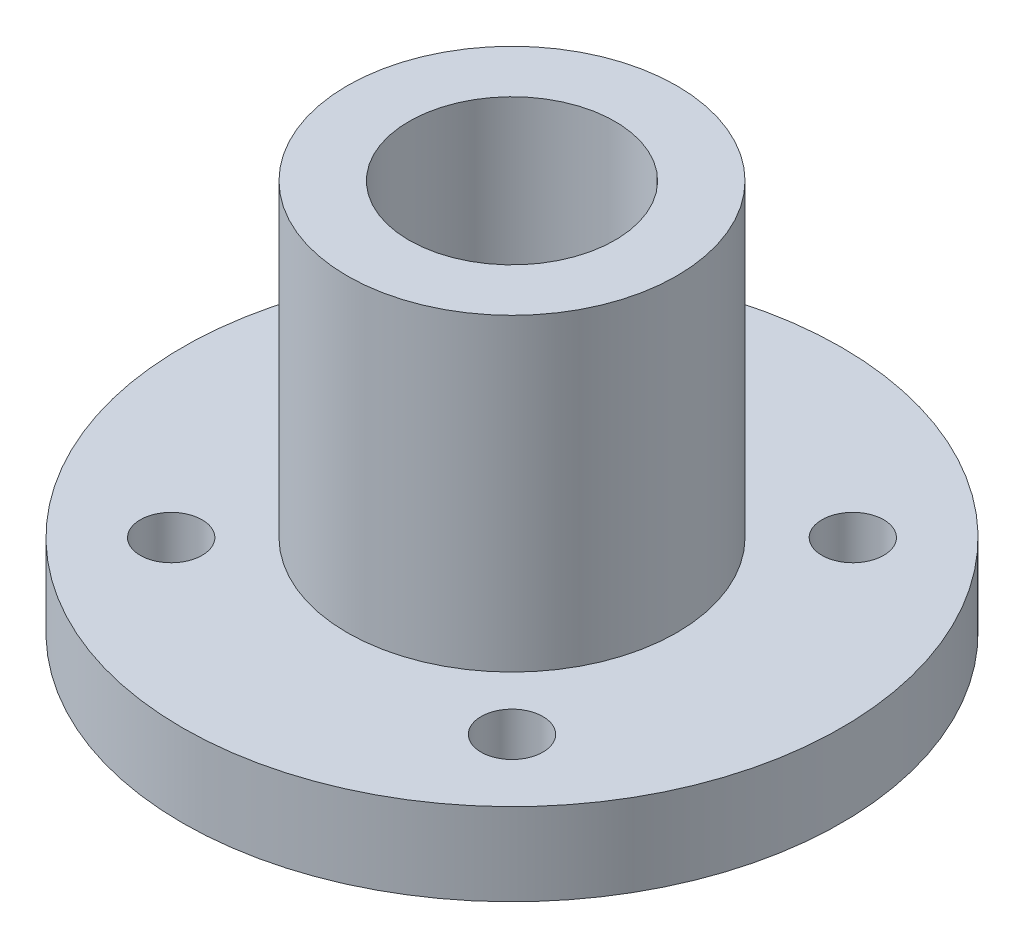
ISO-10303-21;
HEADER;
FILE_DESCRIPTION(('STEP AP214'),'2;1');
FILE_NAME('part.step','',(''),(''),'','','');
FILE_SCHEMA(('AUTOMOTIVE_DESIGN { 1 0 10303 214 1 1 1 1 }'));
ENDSEC;
DATA;
#1=APPLICATION_CONTEXT('core data for automotive mechanical design processes');
#2=APPLICATION_PROTOCOL_DEFINITION('international standard','automotive_design',2000,#1);
#3=PRODUCT_CONTEXT('',#1,'mechanical');
#4=PRODUCT('Part','Part','',(#3));
#5=PRODUCT_RELATED_PRODUCT_CATEGORY('part','',(#4));
#6=PRODUCT_DEFINITION_FORMATION('','',#4);
#7=PRODUCT_DEFINITION_CONTEXT('part definition',#1,'design');
#8=PRODUCT_DEFINITION('design','',#6,#7);
#9=PRODUCT_DEFINITION_SHAPE('','',#8);
#10=(LENGTH_UNIT() NAMED_UNIT(*) SI_UNIT(.MILLI.,.METRE.));
#11=(NAMED_UNIT(*) PLANE_ANGLE_UNIT() SI_UNIT($,.RADIAN.));
#12=(NAMED_UNIT(*) SI_UNIT($,.STERADIAN.) SOLID_ANGLE_UNIT());
#13=UNCERTAINTY_MEASURE_WITH_UNIT(LENGTH_MEASURE(1.E-05),#10,'distance_accuracy_value','');
#14=(GEOMETRIC_REPRESENTATION_CONTEXT(3) GLOBAL_UNCERTAINTY_ASSIGNED_CONTEXT((#13)) GLOBAL_UNIT_ASSIGNED_CONTEXT((#10,
#11,#12)) REPRESENTATION_CONTEXT('',''));
#15=CARTESIAN_POINT('',(0.,0.,0.));
#16=DIRECTION('',(0.,0.,1.));
#17=DIRECTION('',(1.,0.,0.));
#18=AXIS2_PLACEMENT_3D('',#15,#16,#17);
#19=CARTESIAN_POINT('',(0.,4.,0.));
#20=DIRECTION('',(0.,1.,0.));
#21=DIRECTION('',(0.,0.,1.));
#22=AXIS2_PLACEMENT_3D('',#19,#20,#21);
#23=PLANE('',#22);
#24=CARTESIAN_POINT('',(-8.27314933988262,4.,-8.27314933988259));
#25=DIRECTION('',(0.,1.,0.));
#26=DIRECTION('',(0.,0.,1.));
#27=AXIS2_PLACEMENT_3D('',#24,#25,#26);
#28=CIRCLE('',#27,1.5);
#29=CARTESIAN_POINT('',(-8.27314933988262,4.,-6.77314933988259));
#30=VERTEX_POINT('',#29);
#31=EDGE_CURVE('E68',#30,#30,#28,.T.);
#32=ORIENTED_EDGE('',*,*,#31,.F.);
#33=EDGE_LOOP('',(#32));
#34=FACE_BOUND('',#33,.T.);
#35=CARTESIAN_POINT('',(-8.27314933988262,4.,8.27314933988259));
#36=DIRECTION('',(0.,1.,0.));
#37=DIRECTION('',(0.,0.,-1.));
#38=AXIS2_PLACEMENT_3D('',#35,#36,#37);
#39=CIRCLE('',#38,1.5);
#40=CARTESIAN_POINT('',(-8.27314933988262,4.,6.77314933988259));
#41=VERTEX_POINT('',#40);
#42=EDGE_CURVE('E58',#41,#41,#39,.T.);
#43=ORIENTED_EDGE('',*,*,#42,.F.);
#44=EDGE_LOOP('',(#43));
#45=FACE_BOUND('',#44,.T.);
#46=CARTESIAN_POINT('',(8.27314933988262,4.,8.27314933988259));
#47=DIRECTION('',(0.,1.,0.));
#48=DIRECTION('',(0.,0.,1.));
#49=AXIS2_PLACEMENT_3D('',#46,#47,#48);
#50=CIRCLE('',#49,1.5);
#51=CARTESIAN_POINT('',(8.27314933988262,4.,9.77314933988259));
#52=VERTEX_POINT('',#51);
#53=EDGE_CURVE('E48',#52,#52,#50,.T.);
#54=ORIENTED_EDGE('',*,*,#53,.F.);
#55=EDGE_LOOP('',(#54));
#56=FACE_BOUND('',#55,.T.);
#57=CARTESIAN_POINT('',(0.,4.,0.));
#58=DIRECTION('',(0.,1.,0.));
#59=DIRECTION('',(0.,0.,1.));
#60=AXIS2_PLACEMENT_3D('',#57,#58,#59);
#61=CIRCLE('',#60,16.);
#62=CARTESIAN_POINT('',(0.,4.,16.));
#63=VERTEX_POINT('',#62);
#64=EDGE_CURVE('E10',#63,#63,#61,.T.);
#65=ORIENTED_EDGE('',*,*,#64,.T.);
#66=EDGE_LOOP('',(#65));
#67=FACE_BOUND('',#66,.T.);
#68=CARTESIAN_POINT('',(8.27314933988262,4.,-8.27314933988259));
#69=DIRECTION('',(0.,1.,0.));
#70=DIRECTION('',(0.,0.,-1.));
#71=AXIS2_PLACEMENT_3D('',#68,#69,#70);
#72=CIRCLE('',#71,1.5);
#73=CARTESIAN_POINT('',(8.27314933988262,4.,-9.77314933988259));
#74=VERTEX_POINT('',#73);
#75=EDGE_CURVE('E62',#74,#74,#72,.T.);
#76=ORIENTED_EDGE('',*,*,#75,.F.);
#77=EDGE_LOOP('',(#76));
#78=FACE_BOUND('',#77,.T.);
#79=CARTESIAN_POINT('',(0.,4.,0.));
#80=DIRECTION('',(0.,1.,0.));
#81=DIRECTION('',(0.,0.,1.));
#82=AXIS2_PLACEMENT_3D('',#79,#80,#81);
#83=CIRCLE('',#82,8.);
#84=CARTESIAN_POINT('',(0.,4.,8.));
#85=VERTEX_POINT('',#84);
#86=EDGE_CURVE('E77',#85,#85,#83,.T.);
#87=ORIENTED_EDGE('',*,*,#86,.F.);
#88=EDGE_LOOP('',(#87));
#89=FACE_BOUND('',#88,.T.);
#90=ADVANCED_FACE('F37',(#34,#45,#56,#67,#78,#89),#23,.T.);
#91=CARTESIAN_POINT('',(0.,0.,0.));
#92=DIRECTION('',(0.,1.,0.));
#93=DIRECTION('',(0.,0.,1.));
#94=AXIS2_PLACEMENT_3D('',#91,#92,#93);
#95=PLANE('',#94);
#96=CARTESIAN_POINT('',(0.,0.,0.));
#97=DIRECTION('',(0.,1.,0.));
#98=DIRECTION('',(0.,0.,1.));
#99=AXIS2_PLACEMENT_3D('',#96,#97,#98);
#100=CIRCLE('',#99,16.);
#101=CARTESIAN_POINT('',(0.,0.,16.));
#102=VERTEX_POINT('',#101);
#103=EDGE_CURVE('E41',#102,#102,#100,.T.);
#104=ORIENTED_EDGE('',*,*,#103,.F.);
#105=EDGE_LOOP('',(#104));
#106=FACE_BOUND('',#105,.T.);
#107=CARTESIAN_POINT('',(8.27314933988262,0.,8.27314933988259));
#108=DIRECTION('',(0.,1.,0.));
#109=DIRECTION('',(0.,0.,1.));
#110=AXIS2_PLACEMENT_3D('',#107,#108,#109);
#111=CIRCLE('',#110,1.5);
#112=CARTESIAN_POINT('',(8.27314933988262,0.,9.77314933988259));
#113=VERTEX_POINT('',#112);
#114=EDGE_CURVE('E50',#113,#113,#111,.T.);
#115=ORIENTED_EDGE('',*,*,#114,.T.);
#116=EDGE_LOOP('',(#115));
#117=FACE_BOUND('',#116,.T.);
#118=CARTESIAN_POINT('',(0.,0.,0.));
#119=DIRECTION('',(0.,1.,0.));
#120=DIRECTION('',(0.,0.,1.));
#121=AXIS2_PLACEMENT_3D('',#118,#119,#120);
#122=CIRCLE('',#121,5.);
#123=CARTESIAN_POINT('',(0.,0.,5.));
#124=VERTEX_POINT('',#123);
#125=EDGE_CURVE('E53',#124,#124,#122,.T.);
#126=ORIENTED_EDGE('',*,*,#125,.T.);
#127=EDGE_LOOP('',(#126));
#128=FACE_BOUND('',#127,.T.);
#129=CARTESIAN_POINT('',(-8.27314933988262,0.,8.27314933988259));
#130=DIRECTION('',(0.,1.,0.));
#131=DIRECTION('',(0.,0.,-1.));
#132=AXIS2_PLACEMENT_3D('',#129,#130,#131);
#133=CIRCLE('',#132,1.5);
#134=CARTESIAN_POINT('',(-8.27314933988262,0.,6.77314933988259));
#135=VERTEX_POINT('',#134);
#136=EDGE_CURVE('E59',#135,#135,#133,.T.);
#137=ORIENTED_EDGE('',*,*,#136,.T.);
#138=EDGE_LOOP('',(#137));
#139=FACE_BOUND('',#138,.T.);
#140=CARTESIAN_POINT('',(8.27314933988262,0.,-8.27314933988259));
#141=DIRECTION('',(0.,1.,0.));
#142=DIRECTION('',(0.,0.,-1.));
#143=AXIS2_PLACEMENT_3D('',#140,#141,#142);
#144=CIRCLE('',#143,1.5);
#145=CARTESIAN_POINT('',(8.27314933988262,0.,-9.77314933988259));
#146=VERTEX_POINT('',#145);
#147=EDGE_CURVE('E65',#146,#146,#144,.T.);
#148=ORIENTED_EDGE('',*,*,#147,.T.);
#149=EDGE_LOOP('',(#148));
#150=FACE_BOUND('',#149,.T.);
#151=CARTESIAN_POINT('',(-8.27314933988262,0.,-8.27314933988259));
#152=DIRECTION('',(0.,1.,0.));
#153=DIRECTION('',(0.,0.,1.));
#154=AXIS2_PLACEMENT_3D('',#151,#152,#153);
#155=CIRCLE('',#154,1.5);
#156=CARTESIAN_POINT('',(-8.27314933988262,0.,-6.77314933988259));
#157=VERTEX_POINT('',#156);
#158=EDGE_CURVE('E71',#157,#157,#155,.T.);
#159=ORIENTED_EDGE('',*,*,#158,.T.);
#160=EDGE_LOOP('',(#159));
#161=FACE_BOUND('',#160,.T.);
#162=ADVANCED_FACE('F104',(#106,#117,#128,#139,#150,#161),#95,.F.);
#163=CARTESIAN_POINT('',(0.,4.,0.));
#164=DIRECTION('',(0.,-1.,0.));
#165=DIRECTION('',(0.,0.,-1.));
#166=AXIS2_PLACEMENT_3D('',#163,#164,#165);
#167=CYLINDRICAL_SURFACE('',#166,16.);
#168=ORIENTED_EDGE('',*,*,#64,.F.);
#169=EDGE_LOOP('',(#168));
#170=FACE_BOUND('',#169,.T.);
#171=ORIENTED_EDGE('',*,*,#103,.T.);
#172=EDGE_LOOP('',(#171));
#173=FACE_BOUND('',#172,.T.);
#174=ADVANCED_FACE('F39',(#170,#173),#167,.T.);
#175=CARTESIAN_POINT('',(8.27314933988262,4.,8.27314933988259));
#176=DIRECTION('',(0.,-1.,0.));
#177=DIRECTION('',(0.,0.,-1.));
#178=AXIS2_PLACEMENT_3D('',#175,#176,#177);
#179=CYLINDRICAL_SURFACE('',#178,1.5);
#180=ORIENTED_EDGE('',*,*,#53,.T.);
#181=EDGE_LOOP('',(#180));
#182=FACE_BOUND('',#181,.T.);
#183=ORIENTED_EDGE('',*,*,#114,.F.);
#184=EDGE_LOOP('',(#183));
#185=FACE_BOUND('',#184,.T.);
#186=ADVANCED_FACE('F114',(#182,#185),#179,.F.);
#187=CARTESIAN_POINT('',(0.,4.,0.));
#188=DIRECTION('',(0.,-1.,0.));
#189=DIRECTION('',(0.,0.,-1.));
#190=AXIS2_PLACEMENT_3D('',#187,#188,#189);
#191=CYLINDRICAL_SURFACE('',#190,5.);
#192=ORIENTED_EDGE('',*,*,#125,.F.);
#193=EDGE_LOOP('',(#192));
#194=FACE_BOUND('',#193,.T.);
#195=CARTESIAN_POINT('',(0.,19.,0.));
#196=DIRECTION('',(0.,1.,0.));
#197=DIRECTION('',(0.,0.,1.));
#198=AXIS2_PLACEMENT_3D('',#195,#196,#197);
#199=CIRCLE('',#198,5.);
#200=CARTESIAN_POINT('',(0.,19.,5.));
#201=VERTEX_POINT('',#200);
#202=EDGE_CURVE('E80',#201,#201,#199,.T.);
#203=ORIENTED_EDGE('',*,*,#202,.T.);
#204=EDGE_LOOP('',(#203));
#205=FACE_BOUND('',#204,.T.);
#206=ADVANCED_FACE('F86',(#194,#205),#191,.F.);
#207=CARTESIAN_POINT('',(-8.27314933988262,4.,8.27314933988259));
#208=DIRECTION('',(0.,-1.,0.));
#209=DIRECTION('',(0.,0.,-1.));
#210=AXIS2_PLACEMENT_3D('',#207,#208,#209);
#211=CYLINDRICAL_SURFACE('',#210,1.5);
#212=ORIENTED_EDGE('',*,*,#42,.T.);
#213=EDGE_LOOP('',(#212));
#214=FACE_BOUND('',#213,.T.);
#215=ORIENTED_EDGE('',*,*,#136,.F.);
#216=EDGE_LOOP('',(#215));
#217=FACE_BOUND('',#216,.T.);
#218=ADVANCED_FACE('F120',(#214,#217),#211,.F.);
#219=CARTESIAN_POINT('',(8.27314933988262,4.,-8.27314933988259));
#220=DIRECTION('',(0.,-1.,0.));
#221=DIRECTION('',(0.,0.,-1.));
#222=AXIS2_PLACEMENT_3D('',#219,#220,#221);
#223=CYLINDRICAL_SURFACE('',#222,1.5);
#224=ORIENTED_EDGE('',*,*,#75,.T.);
#225=EDGE_LOOP('',(#224));
#226=FACE_BOUND('',#225,.T.);
#227=ORIENTED_EDGE('',*,*,#147,.F.);
#228=EDGE_LOOP('',(#227));
#229=FACE_BOUND('',#228,.T.);
#230=ADVANCED_FACE('F100',(#226,#229),#223,.F.);
#231=CARTESIAN_POINT('',(-8.27314933988262,4.,-8.27314933988259));
#232=DIRECTION('',(0.,-1.,0.));
#233=DIRECTION('',(0.,0.,-1.));
#234=AXIS2_PLACEMENT_3D('',#231,#232,#233);
#235=CYLINDRICAL_SURFACE('',#234,1.5);
#236=ORIENTED_EDGE('',*,*,#31,.T.);
#237=EDGE_LOOP('',(#236));
#238=FACE_BOUND('',#237,.T.);
#239=ORIENTED_EDGE('',*,*,#158,.F.);
#240=EDGE_LOOP('',(#239));
#241=FACE_BOUND('',#240,.T.);
#242=ADVANCED_FACE('F91',(#238,#241),#235,.F.);
#243=CARTESIAN_POINT('',(0.,19.,0.));
#244=DIRECTION('',(0.,1.,0.));
#245=DIRECTION('',(0.,0.,1.));
#246=AXIS2_PLACEMENT_3D('',#243,#244,#245);
#247=PLANE('',#246);
#248=CARTESIAN_POINT('',(0.,19.,0.));
#249=DIRECTION('',(0.,1.,0.));
#250=DIRECTION('',(0.,0.,1.));
#251=AXIS2_PLACEMENT_3D('',#248,#249,#250);
#252=CIRCLE('',#251,8.);
#253=CARTESIAN_POINT('',(0.,19.,8.));
#254=VERTEX_POINT('',#253);
#255=EDGE_CURVE('E74',#254,#254,#252,.T.);
#256=ORIENTED_EDGE('',*,*,#255,.T.);
#257=EDGE_LOOP('',(#256));
#258=FACE_BOUND('',#257,.T.);
#259=ORIENTED_EDGE('',*,*,#202,.F.);
#260=EDGE_LOOP('',(#259));
#261=FACE_BOUND('',#260,.T.);
#262=ADVANCED_FACE('F88',(#258,#261),#247,.T.);
#263=CARTESIAN_POINT('',(0.,19.,0.));
#264=DIRECTION('',(0.,-1.,0.));
#265=DIRECTION('',(0.,0.,-1.));
#266=AXIS2_PLACEMENT_3D('',#263,#264,#265);
#267=CYLINDRICAL_SURFACE('',#266,8.);
#268=ORIENTED_EDGE('',*,*,#255,.F.);
#269=EDGE_LOOP('',(#268));
#270=FACE_BOUND('',#269,.T.);
#271=ORIENTED_EDGE('',*,*,#86,.T.);
#272=EDGE_LOOP('',(#271));
#273=FACE_BOUND('',#272,.T.);
#274=ADVANCED_FACE('F90',(#270,#273),#267,.T.);
#275=CLOSED_SHELL('',(#90,#162,#174,#186,#206,#218,#230,#242,#262,#274));
#276=MANIFOLD_SOLID_BREP('B2',#275);
#277=ADVANCED_BREP_SHAPE_REPRESENTATION('',(#18,#276),#14);
#278=SHAPE_DEFINITION_REPRESENTATION(#9,#277);
ENDSEC;
END-ISO-10303-21;
